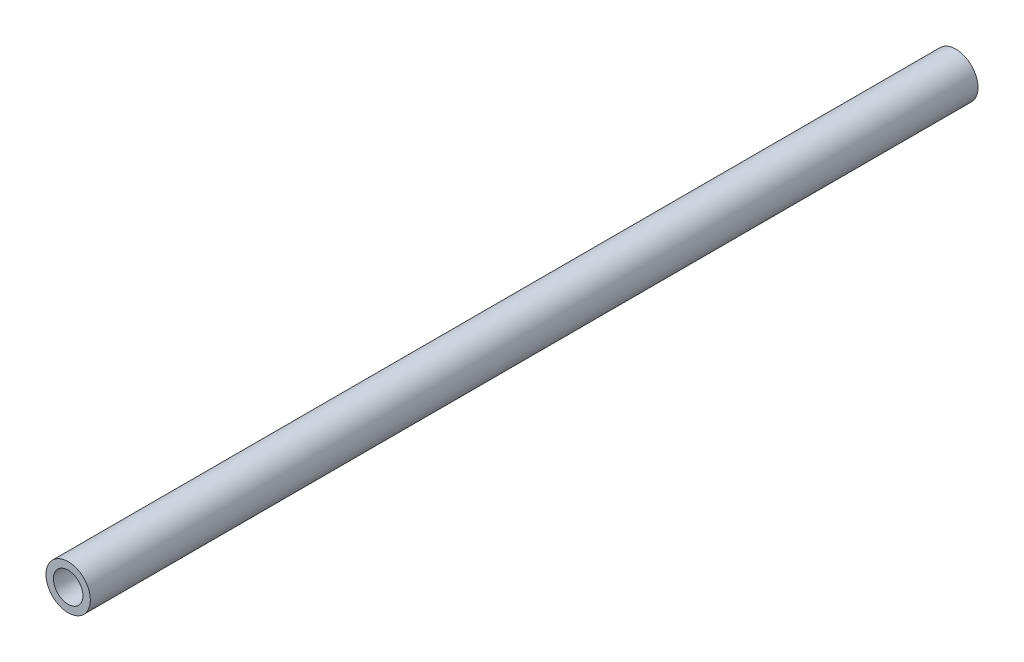
ISO-10303-21;
HEADER;
FILE_DESCRIPTION(('STEP AP214'),'2;1');
FILE_NAME('part.step','',(''),(''),'','','');
FILE_SCHEMA(('AUTOMOTIVE_DESIGN { 1 0 10303 214 1 1 1 1 }'));
ENDSEC;
DATA;
#1=APPLICATION_CONTEXT('core data for automotive mechanical design processes');
#2=APPLICATION_PROTOCOL_DEFINITION('international standard','automotive_design',2000,#1);
#3=PRODUCT_CONTEXT('',#1,'mechanical');
#4=PRODUCT('Part','Part','',(#3));
#5=PRODUCT_RELATED_PRODUCT_CATEGORY('part','',(#4));
#6=PRODUCT_DEFINITION_FORMATION('','',#4);
#7=PRODUCT_DEFINITION_CONTEXT('part definition',#1,'design');
#8=PRODUCT_DEFINITION('design','',#6,#7);
#9=PRODUCT_DEFINITION_SHAPE('','',#8);
#10=(LENGTH_UNIT() NAMED_UNIT(*) SI_UNIT(.MILLI.,.METRE.));
#11=(NAMED_UNIT(*) PLANE_ANGLE_UNIT() SI_UNIT($,.RADIAN.));
#12=(NAMED_UNIT(*) SI_UNIT($,.STERADIAN.) SOLID_ANGLE_UNIT());
#13=UNCERTAINTY_MEASURE_WITH_UNIT(LENGTH_MEASURE(1.E-05),#10,'distance_accuracy_value','');
#14=(GEOMETRIC_REPRESENTATION_CONTEXT(3) GLOBAL_UNCERTAINTY_ASSIGNED_CONTEXT((#13)) GLOBAL_UNIT_ASSIGNED_CONTEXT((#10,
#11,#12)) REPRESENTATION_CONTEXT('',''));
#15=CARTESIAN_POINT('',(0.,0.,0.));
#16=DIRECTION('',(0.,0.,1.));
#17=DIRECTION('',(1.,0.,0.));
#18=AXIS2_PLACEMENT_3D('',#15,#16,#17);
#19=CARTESIAN_POINT('',(0.,0.,304.8));
#20=DIRECTION('',(0.,0.,1.));
#21=DIRECTION('',(1.,0.,0.));
#22=AXIS2_PLACEMENT_3D('',#19,#20,#21);
#23=PLANE('',#22);
#24=CARTESIAN_POINT('',(0.,0.,304.8));
#25=DIRECTION('',(0.,0.,1.));
#26=DIRECTION('',(1.,0.,0.));
#27=AXIS2_PLACEMENT_3D('',#24,#25,#26);
#28=CIRCLE('',#27,7.62);
#29=CARTESIAN_POINT('',(7.62,0.,304.8));
#30=VERTEX_POINT('',#29);
#31=EDGE_CURVE('E10',#30,#30,#28,.T.);
#32=ORIENTED_EDGE('',*,*,#31,.T.);
#33=EDGE_LOOP('',(#32));
#34=FACE_BOUND('',#33,.T.);
#35=CARTESIAN_POINT('',(0.,0.,304.8));
#36=DIRECTION('',(0.,0.,1.));
#37=DIRECTION('',(1.,0.,0.));
#38=AXIS2_PLACEMENT_3D('',#35,#36,#37);
#39=CIRCLE('',#38,5.08);
#40=CARTESIAN_POINT('',(5.08,0.,304.8));
#41=VERTEX_POINT('',#40);
#42=EDGE_CURVE('E41',#41,#41,#39,.T.);
#43=ORIENTED_EDGE('',*,*,#42,.F.);
#44=EDGE_LOOP('',(#43));
#45=FACE_BOUND('',#44,.T.);
#46=ADVANCED_FACE('F30',(#34,#45),#23,.T.);
#47=CARTESIAN_POINT('',(0.,0.,0.));
#48=DIRECTION('',(0.,0.,1.));
#49=DIRECTION('',(1.,0.,0.));
#50=AXIS2_PLACEMENT_3D('',#47,#48,#49);
#51=PLANE('',#50);
#52=CARTESIAN_POINT('',(0.,0.,0.));
#53=DIRECTION('',(0.,0.,1.));
#54=DIRECTION('',(1.,0.,0.));
#55=AXIS2_PLACEMENT_3D('',#52,#53,#54);
#56=CIRCLE('',#55,7.62);
#57=CARTESIAN_POINT('',(7.62,0.,0.));
#58=VERTEX_POINT('',#57);
#59=EDGE_CURVE('E34',#58,#58,#56,.T.);
#60=ORIENTED_EDGE('',*,*,#59,.F.);
#61=EDGE_LOOP('',(#60));
#62=FACE_BOUND('',#61,.T.);
#63=CARTESIAN_POINT('',(0.,0.,0.));
#64=DIRECTION('',(0.,0.,1.));
#65=DIRECTION('',(1.,0.,0.));
#66=AXIS2_PLACEMENT_3D('',#63,#64,#65);
#67=CIRCLE('',#66,5.08);
#68=CARTESIAN_POINT('',(5.08,0.,0.));
#69=VERTEX_POINT('',#68);
#70=EDGE_CURVE('E43',#69,#69,#67,.T.);
#71=ORIENTED_EDGE('',*,*,#70,.T.);
#72=EDGE_LOOP('',(#71));
#73=FACE_BOUND('',#72,.T.);
#74=ADVANCED_FACE('F53',(#62,#73),#51,.F.);
#75=CARTESIAN_POINT('',(0.,0.,304.8));
#76=DIRECTION('',(0.,0.,-1.));
#77=DIRECTION('',(-1.,0.,0.));
#78=AXIS2_PLACEMENT_3D('',#75,#76,#77);
#79=CYLINDRICAL_SURFACE('',#78,7.62);
#80=ORIENTED_EDGE('',*,*,#31,.F.);
#81=EDGE_LOOP('',(#80));
#82=FACE_BOUND('',#81,.T.);
#83=ORIENTED_EDGE('',*,*,#59,.T.);
#84=EDGE_LOOP('',(#83));
#85=FACE_BOUND('',#84,.T.);
#86=ADVANCED_FACE('F32',(#82,#85),#79,.T.);
#87=CARTESIAN_POINT('',(0.,0.,304.8));
#88=DIRECTION('',(0.,0.,-1.));
#89=DIRECTION('',(-1.,0.,0.));
#90=AXIS2_PLACEMENT_3D('',#87,#88,#89);
#91=CYLINDRICAL_SURFACE('',#90,5.08);
#92=ORIENTED_EDGE('',*,*,#42,.T.);
#93=EDGE_LOOP('',(#92));
#94=FACE_BOUND('',#93,.T.);
#95=ORIENTED_EDGE('',*,*,#70,.F.);
#96=EDGE_LOOP('',(#95));
#97=FACE_BOUND('',#96,.T.);
#98=ADVANCED_FACE('F49',(#94,#97),#91,.F.);
#99=CLOSED_SHELL('',(#46,#74,#86,#98));
#100=MANIFOLD_SOLID_BREP('B2',#99);
#101=ADVANCED_BREP_SHAPE_REPRESENTATION('',(#18,#100),#14);
#102=SHAPE_DEFINITION_REPRESENTATION(#9,#101);
ENDSEC;
END-ISO-10303-21;
